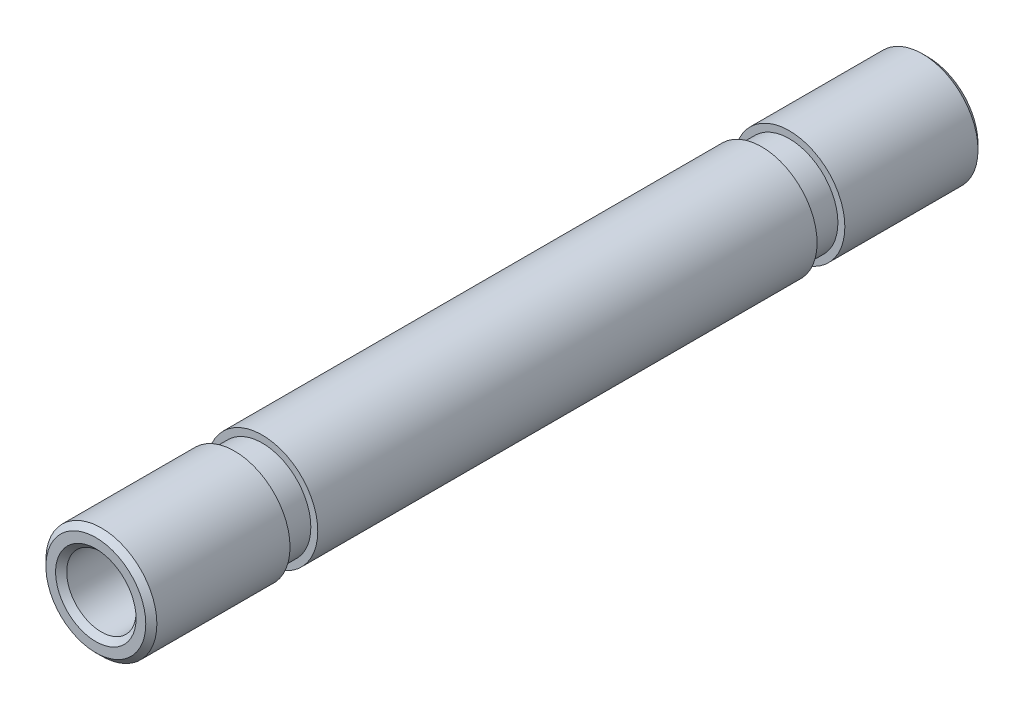
ISO-10303-21;
HEADER;
FILE_DESCRIPTION(('STEP AP214'),'2;1');
FILE_NAME('part.step','',(''),(''),'','','');
FILE_SCHEMA(('AUTOMOTIVE_DESIGN { 1 0 10303 214 1 1 1 1 }'));
ENDSEC;
DATA;
#1=APPLICATION_CONTEXT('core data for automotive mechanical design processes');
#2=APPLICATION_PROTOCOL_DEFINITION('international standard','automotive_design',2000,#1);
#3=PRODUCT_CONTEXT('',#1,'mechanical');
#4=PRODUCT('Part','Part','',(#3));
#5=PRODUCT_RELATED_PRODUCT_CATEGORY('part','',(#4));
#6=PRODUCT_DEFINITION_FORMATION('','',#4);
#7=PRODUCT_DEFINITION_CONTEXT('part definition',#1,'design');
#8=PRODUCT_DEFINITION('design','',#6,#7);
#9=PRODUCT_DEFINITION_SHAPE('','',#8);
#10=(LENGTH_UNIT() NAMED_UNIT(*) SI_UNIT(.MILLI.,.METRE.));
#11=(NAMED_UNIT(*) PLANE_ANGLE_UNIT() SI_UNIT($,.RADIAN.));
#12=(NAMED_UNIT(*) SI_UNIT($,.STERADIAN.) SOLID_ANGLE_UNIT());
#13=UNCERTAINTY_MEASURE_WITH_UNIT(LENGTH_MEASURE(1.E-05),#10,'distance_accuracy_value','');
#14=(GEOMETRIC_REPRESENTATION_CONTEXT(3) GLOBAL_UNCERTAINTY_ASSIGNED_CONTEXT((#13)) GLOBAL_UNIT_ASSIGNED_CONTEXT((#10,
#11,#12)) REPRESENTATION_CONTEXT('',''));
#15=CARTESIAN_POINT('',(0.,0.,0.));
#16=DIRECTION('',(0.,0.,1.));
#17=DIRECTION('',(1.,0.,0.));
#18=AXIS2_PLACEMENT_3D('',#15,#16,#17);
#19=CARTESIAN_POINT('',(0.,0.,-30.));
#20=DIRECTION('',(0.,0.,1.));
#21=DIRECTION('',(1.,0.,0.));
#22=AXIS2_PLACEMENT_3D('',#19,#20,#21);
#23=CYLINDRICAL_SURFACE('',#22,2.);
#24=CARTESIAN_POINT('',(0.,0.,-29.8));
#25=DIRECTION('',(0.,0.,1.));
#26=DIRECTION('',(1.,0.,0.));
#27=AXIS2_PLACEMENT_3D('',#24,#25,#26);
#28=CIRCLE('',#27,2.);
#29=CARTESIAN_POINT('',(2.,0.,-29.8));
#30=VERTEX_POINT('',#29);
#31=EDGE_CURVE('E36',#30,#30,#28,.T.);
#32=ORIENTED_EDGE('',*,*,#31,.T.);
#33=EDGE_LOOP('',(#32));
#34=FACE_BOUND('',#33,.T.);
#35=CARTESIAN_POINT('',(0.,0.,-25.));
#36=DIRECTION('',(0.,0.,1.));
#37=DIRECTION('',(1.,0.,0.));
#38=AXIS2_PLACEMENT_3D('',#35,#36,#37);
#39=CIRCLE('',#38,2.);
#40=CARTESIAN_POINT('',(2.,0.,-25.));
#41=VERTEX_POINT('',#40);
#42=EDGE_CURVE('E58',#41,#41,#39,.T.);
#43=ORIENTED_EDGE('',*,*,#42,.F.);
#44=EDGE_LOOP('',(#43));
#45=FACE_BOUND('',#44,.T.);
#46=ADVANCED_FACE('F13',(#34,#45),#23,.T.);
#47=CARTESIAN_POINT('',(0.,0.,-24.));
#48=DIRECTION('',(0.,0.,1.));
#49=DIRECTION('',(1.,0.,0.));
#50=AXIS2_PLACEMENT_3D('',#47,#48,#49);
#51=CIRCLE('',#50,2.);
#52=CARTESIAN_POINT('',(2.,0.,-24.));
#53=VERTEX_POINT('',#52);
#54=EDGE_CURVE('E55',#53,#53,#51,.T.);
#55=ORIENTED_EDGE('',*,*,#54,.T.);
#56=EDGE_LOOP('',(#55));
#57=FACE_BOUND('',#56,.T.);
#58=CARTESIAN_POINT('',(0.,0.,-6.));
#59=DIRECTION('',(0.,0.,1.));
#60=DIRECTION('',(1.,0.,0.));
#61=AXIS2_PLACEMENT_3D('',#58,#59,#60);
#62=CIRCLE('',#61,2.);
#63=CARTESIAN_POINT('',(2.,0.,-6.));
#64=VERTEX_POINT('',#63);
#65=EDGE_CURVE('E45',#64,#64,#62,.T.);
#66=ORIENTED_EDGE('',*,*,#65,.F.);
#67=EDGE_LOOP('',(#66));
#68=FACE_BOUND('',#67,.T.);
#69=ADVANCED_FACE('F92',(#57,#68),#23,.T.);
#70=CARTESIAN_POINT('',(0.,0.,-0.199999999999999));
#71=DIRECTION('',(0.,0.,1.));
#72=DIRECTION('',(1.,0.,0.));
#73=AXIS2_PLACEMENT_3D('',#70,#71,#72);
#74=CIRCLE('',#73,2.);
#75=CARTESIAN_POINT('',(2.,0.,-0.199999999999999));
#76=VERTEX_POINT('',#75);
#77=EDGE_CURVE('E39',#76,#76,#74,.F.);
#78=ORIENTED_EDGE('',*,*,#77,.T.);
#79=EDGE_LOOP('',(#78));
#80=FACE_BOUND('',#79,.T.);
#81=CARTESIAN_POINT('',(0.,0.,-5.));
#82=DIRECTION('',(0.,0.,1.));
#83=DIRECTION('',(1.,0.,0.));
#84=AXIS2_PLACEMENT_3D('',#81,#82,#83);
#85=CIRCLE('',#84,2.);
#86=CARTESIAN_POINT('',(2.,0.,-5.));
#87=VERTEX_POINT('',#86);
#88=EDGE_CURVE('E46',#87,#87,#85,.T.);
#89=ORIENTED_EDGE('',*,*,#88,.T.);
#90=EDGE_LOOP('',(#89));
#91=FACE_BOUND('',#90,.T.);
#92=ADVANCED_FACE('F95',(#80,#91),#23,.T.);
#93=CARTESIAN_POINT('',(0.,0.,-30.));
#94=DIRECTION('',(0.,0.,1.));
#95=DIRECTION('',(1.,0.,0.));
#96=AXIS2_PLACEMENT_3D('',#93,#94,#95);
#97=PLANE('',#96);
#98=CARTESIAN_POINT('',(0.,0.,-30.));
#99=DIRECTION('',(0.,0.,1.));
#100=DIRECTION('',(1.,0.,0.));
#101=AXIS2_PLACEMENT_3D('',#98,#99,#100);
#102=CIRCLE('',#101,1.45);
#103=CARTESIAN_POINT('',(1.45,0.,-30.));
#104=VERTEX_POINT('',#103);
#105=EDGE_CURVE('E20',#104,#104,#102,.T.);
#106=ORIENTED_EDGE('',*,*,#105,.T.);
#107=EDGE_LOOP('',(#106));
#108=FACE_BOUND('',#107,.T.);
#109=CARTESIAN_POINT('',(0.,0.,-30.));
#110=DIRECTION('',(0.,0.,1.));
#111=DIRECTION('',(1.,0.,0.));
#112=AXIS2_PLACEMENT_3D('',#109,#110,#111);
#113=CIRCLE('',#112,1.8);
#114=CARTESIAN_POINT('',(1.8,0.,-30.));
#115=VERTEX_POINT('',#114);
#116=EDGE_CURVE('E33',#115,#115,#113,.F.);
#117=ORIENTED_EDGE('',*,*,#116,.T.);
#118=EDGE_LOOP('',(#117));
#119=FACE_BOUND('',#118,.T.);
#120=ADVANCED_FACE('F104',(#108,#119),#97,.F.);
#121=CARTESIAN_POINT('',(0.,0.,0.));
#122=DIRECTION('',(0.,0.,1.));
#123=DIRECTION('',(1.,0.,0.));
#124=AXIS2_PLACEMENT_3D('',#121,#122,#123);
#125=PLANE('',#124);
#126=CARTESIAN_POINT('',(0.,0.,0.));
#127=DIRECTION('',(0.,0.,1.));
#128=DIRECTION('',(1.,0.,0.));
#129=AXIS2_PLACEMENT_3D('',#126,#127,#128);
#130=CIRCLE('',#129,1.45);
#131=CARTESIAN_POINT('',(1.45,0.,0.));
#132=VERTEX_POINT('',#131);
#133=EDGE_CURVE('E24',#132,#132,#130,.F.);
#134=ORIENTED_EDGE('',*,*,#133,.T.);
#135=EDGE_LOOP('',(#134));
#136=FACE_BOUND('',#135,.T.);
#137=CARTESIAN_POINT('',(0.,0.,0.));
#138=DIRECTION('',(0.,0.,1.));
#139=DIRECTION('',(1.,0.,0.));
#140=AXIS2_PLACEMENT_3D('',#137,#138,#139);
#141=CIRCLE('',#140,1.8);
#142=CARTESIAN_POINT('',(1.8,0.,0.));
#143=VERTEX_POINT('',#142);
#144=EDGE_CURVE('E42',#143,#143,#141,.T.);
#145=ORIENTED_EDGE('',*,*,#144,.T.);
#146=EDGE_LOOP('',(#145));
#147=FACE_BOUND('',#146,.T.);
#148=ADVANCED_FACE('F109',(#136,#147),#125,.T.);
#149=CARTESIAN_POINT('',(0.,0.,-30.));
#150=DIRECTION('',(0.,0.,1.));
#151=DIRECTION('',(1.,0.,0.));
#152=AXIS2_PLACEMENT_3D('',#149,#150,#151);
#153=CYLINDRICAL_SURFACE('',#152,1.25);
#154=CARTESIAN_POINT('',(0.,0.,-29.8));
#155=DIRECTION('',(0.,0.,1.));
#156=DIRECTION('',(1.,0.,0.));
#157=AXIS2_PLACEMENT_3D('',#154,#155,#156);
#158=CIRCLE('',#157,1.25);
#159=CARTESIAN_POINT('',(1.25,0.,-29.8));
#160=VERTEX_POINT('',#159);
#161=EDGE_CURVE('E9',#160,#160,#158,.F.);
#162=ORIENTED_EDGE('',*,*,#161,.T.);
#163=EDGE_LOOP('',(#162));
#164=FACE_BOUND('',#163,.T.);
#165=CARTESIAN_POINT('',(0.,0.,-0.199999999999999));
#166=DIRECTION('',(0.,0.,1.));
#167=DIRECTION('',(1.,0.,0.));
#168=AXIS2_PLACEMENT_3D('',#165,#166,#167);
#169=CIRCLE('',#168,1.25);
#170=CARTESIAN_POINT('',(1.25,0.,-0.199999999999999));
#171=VERTEX_POINT('',#170);
#172=EDGE_CURVE('E28',#171,#171,#169,.T.);
#173=ORIENTED_EDGE('',*,*,#172,.T.);
#174=EDGE_LOOP('',(#173));
#175=FACE_BOUND('',#174,.T.);
#176=ADVANCED_FACE('F125',(#164,#175),#153,.F.);
#177=CARTESIAN_POINT('',(0.,0.,-6.));
#178=DIRECTION('',(0.,0.,1.));
#179=DIRECTION('',(1.,0.,0.));
#180=AXIS2_PLACEMENT_3D('',#177,#178,#179);
#181=PLANE('',#180);
#182=CARTESIAN_POINT('',(0.,0.,-6.));
#183=DIRECTION('',(0.,0.,1.));
#184=DIRECTION('',(1.,0.,0.));
#185=AXIS2_PLACEMENT_3D('',#182,#183,#184);
#186=CIRCLE('',#185,1.75);
#187=CARTESIAN_POINT('',(1.75,0.,-6.));
#188=VERTEX_POINT('',#187);
#189=EDGE_CURVE('E49',#188,#188,#186,.T.);
#190=ORIENTED_EDGE('',*,*,#189,.F.);
#191=EDGE_LOOP('',(#190));
#192=FACE_BOUND('',#191,.T.);
#193=ORIENTED_EDGE('',*,*,#65,.T.);
#194=EDGE_LOOP('',(#193));
#195=FACE_BOUND('',#194,.T.);
#196=ADVANCED_FACE('F117',(#192,#195),#181,.T.);
#197=CARTESIAN_POINT('',(0.,0.,-5.));
#198=DIRECTION('',(0.,0.,1.));
#199=DIRECTION('',(1.,0.,0.));
#200=AXIS2_PLACEMENT_3D('',#197,#198,#199);
#201=PLANE('',#200);
#202=CARTESIAN_POINT('',(0.,0.,-5.));
#203=DIRECTION('',(0.,0.,1.));
#204=DIRECTION('',(1.,0.,0.));
#205=AXIS2_PLACEMENT_3D('',#202,#203,#204);
#206=CIRCLE('',#205,1.75);
#207=CARTESIAN_POINT('',(1.75,0.,-5.));
#208=VERTEX_POINT('',#207);
#209=EDGE_CURVE('E52',#208,#208,#206,.T.);
#210=ORIENTED_EDGE('',*,*,#209,.T.);
#211=EDGE_LOOP('',(#210));
#212=FACE_BOUND('',#211,.T.);
#213=ORIENTED_EDGE('',*,*,#88,.F.);
#214=EDGE_LOOP('',(#213));
#215=FACE_BOUND('',#214,.T.);
#216=ADVANCED_FACE('F115',(#212,#215),#201,.F.);
#217=CARTESIAN_POINT('',(0.,0.,-6.));
#218=DIRECTION('',(0.,0.,1.));
#219=DIRECTION('',(1.,0.,0.));
#220=AXIS2_PLACEMENT_3D('',#217,#218,#219);
#221=CYLINDRICAL_SURFACE('',#220,1.75);
#222=ORIENTED_EDGE('',*,*,#189,.T.);
#223=EDGE_LOOP('',(#222));
#224=FACE_BOUND('',#223,.T.);
#225=ORIENTED_EDGE('',*,*,#209,.F.);
#226=EDGE_LOOP('',(#225));
#227=FACE_BOUND('',#226,.T.);
#228=ADVANCED_FACE('F87',(#224,#227),#221,.T.);
#229=CARTESIAN_POINT('',(0.,0.,-24.));
#230=DIRECTION('',(0.,0.,1.));
#231=DIRECTION('',(1.,0.,0.));
#232=AXIS2_PLACEMENT_3D('',#229,#230,#231);
#233=PLANE('',#232);
#234=ORIENTED_EDGE('',*,*,#54,.F.);
#235=EDGE_LOOP('',(#234));
#236=FACE_BOUND('',#235,.T.);
#237=CARTESIAN_POINT('',(0.,0.,-24.));
#238=DIRECTION('',(0.,0.,1.));
#239=DIRECTION('',(1.,0.,0.));
#240=AXIS2_PLACEMENT_3D('',#237,#238,#239);
#241=CIRCLE('',#240,1.75);
#242=CARTESIAN_POINT('',(1.75,0.,-24.));
#243=VERTEX_POINT('',#242);
#244=EDGE_CURVE('E61',#243,#243,#241,.T.);
#245=ORIENTED_EDGE('',*,*,#244,.T.);
#246=EDGE_LOOP('',(#245));
#247=FACE_BOUND('',#246,.T.);
#248=ADVANCED_FACE('F70',(#236,#247),#233,.F.);
#249=CARTESIAN_POINT('',(0.,0.,-25.));
#250=DIRECTION('',(0.,0.,1.));
#251=DIRECTION('',(1.,0.,0.));
#252=AXIS2_PLACEMENT_3D('',#249,#250,#251);
#253=PLANE('',#252);
#254=ORIENTED_EDGE('',*,*,#42,.T.);
#255=EDGE_LOOP('',(#254));
#256=FACE_BOUND('',#255,.T.);
#257=CARTESIAN_POINT('',(0.,0.,-25.));
#258=DIRECTION('',(0.,0.,1.));
#259=DIRECTION('',(1.,0.,0.));
#260=AXIS2_PLACEMENT_3D('',#257,#258,#259);
#261=CIRCLE('',#260,1.75);
#262=CARTESIAN_POINT('',(1.75,0.,-25.));
#263=VERTEX_POINT('',#262);
#264=EDGE_CURVE('E64',#263,#263,#261,.T.);
#265=ORIENTED_EDGE('',*,*,#264,.F.);
#266=EDGE_LOOP('',(#265));
#267=FACE_BOUND('',#266,.T.);
#268=ADVANCED_FACE('F76',(#256,#267),#253,.T.);
#269=CARTESIAN_POINT('',(0.,0.,-24.));
#270=DIRECTION('',(0.,0.,-1.));
#271=DIRECTION('',(-1.,0.,0.));
#272=AXIS2_PLACEMENT_3D('',#269,#270,#271);
#273=CYLINDRICAL_SURFACE('',#272,1.75);
#274=ORIENTED_EDGE('',*,*,#244,.F.);
#275=EDGE_LOOP('',(#274));
#276=FACE_BOUND('',#275,.T.);
#277=ORIENTED_EDGE('',*,*,#264,.T.);
#278=EDGE_LOOP('',(#277));
#279=FACE_BOUND('',#278,.T.);
#280=ADVANCED_FACE('F72',(#276,#279),#273,.T.);
#281=CARTESIAN_POINT('',(0.,0.,0.));
#282=DIRECTION('',(0.,0.,-1.));
#283=DIRECTION('',(-1.,0.,0.));
#284=AXIS2_PLACEMENT_3D('',#281,#282,#283);
#285=CONICAL_SURFACE('',#284,1.8,0.785398163397453);
#286=ORIENTED_EDGE('',*,*,#77,.F.);
#287=EDGE_LOOP('',(#286));
#288=FACE_BOUND('',#287,.T.);
#289=ORIENTED_EDGE('',*,*,#144,.F.);
#290=EDGE_LOOP('',(#289));
#291=FACE_BOUND('',#290,.T.);
#292=ADVANCED_FACE('F75',(#288,#291),#285,.T.);
#293=CARTESIAN_POINT('',(0.,0.,-29.8));
#294=DIRECTION('',(0.,0.,1.));
#295=DIRECTION('',(1.,0.,0.));
#296=AXIS2_PLACEMENT_3D('',#293,#294,#295);
#297=CONICAL_SURFACE('',#296,2.,0.785398163397427);
#298=ORIENTED_EDGE('',*,*,#116,.F.);
#299=EDGE_LOOP('',(#298));
#300=FACE_BOUND('',#299,.T.);
#301=ORIENTED_EDGE('',*,*,#31,.F.);
#302=EDGE_LOOP('',(#301));
#303=FACE_BOUND('',#302,.T.);
#304=ADVANCED_FACE('F139',(#300,#303),#297,.T.);
#305=CARTESIAN_POINT('',(0.,0.,-0.199999999999999));
#306=DIRECTION('',(0.,0.,1.));
#307=DIRECTION('',(1.,0.,0.));
#308=AXIS2_PLACEMENT_3D('',#305,#306,#307);
#309=CONICAL_SURFACE('',#308,1.25,0.785398163397451);
#310=ORIENTED_EDGE('',*,*,#133,.F.);
#311=EDGE_LOOP('',(#310));
#312=FACE_BOUND('',#311,.T.);
#313=ORIENTED_EDGE('',*,*,#172,.F.);
#314=EDGE_LOOP('',(#313));
#315=FACE_BOUND('',#314,.T.);
#316=ADVANCED_FACE('F144',(#312,#315),#309,.F.);
#317=CARTESIAN_POINT('',(0.,0.,-30.));
#318=DIRECTION('',(0.,0.,-1.));
#319=DIRECTION('',(-1.,0.,0.));
#320=AXIS2_PLACEMENT_3D('',#317,#318,#319);
#321=CONICAL_SURFACE('',#320,1.45,0.785398163397442);
#322=ORIENTED_EDGE('',*,*,#161,.F.);
#323=EDGE_LOOP('',(#322));
#324=FACE_BOUND('',#323,.T.);
#325=ORIENTED_EDGE('',*,*,#105,.F.);
#326=EDGE_LOOP('',(#325));
#327=FACE_BOUND('',#326,.T.);
#328=ADVANCED_FACE('F15',(#324,#327),#321,.F.);
#329=CLOSED_SHELL('',(#46,#69,#92,#120,#148,#176,#196,#216,#228,#248,#268,#280,#292,#304,#316,#328));
#330=MANIFOLD_SOLID_BREP('B1',#329);
#331=ADVANCED_BREP_SHAPE_REPRESENTATION('',(#18,#330),#14);
#332=SHAPE_DEFINITION_REPRESENTATION(#9,#331);
ENDSEC;
END-ISO-10303-21;
